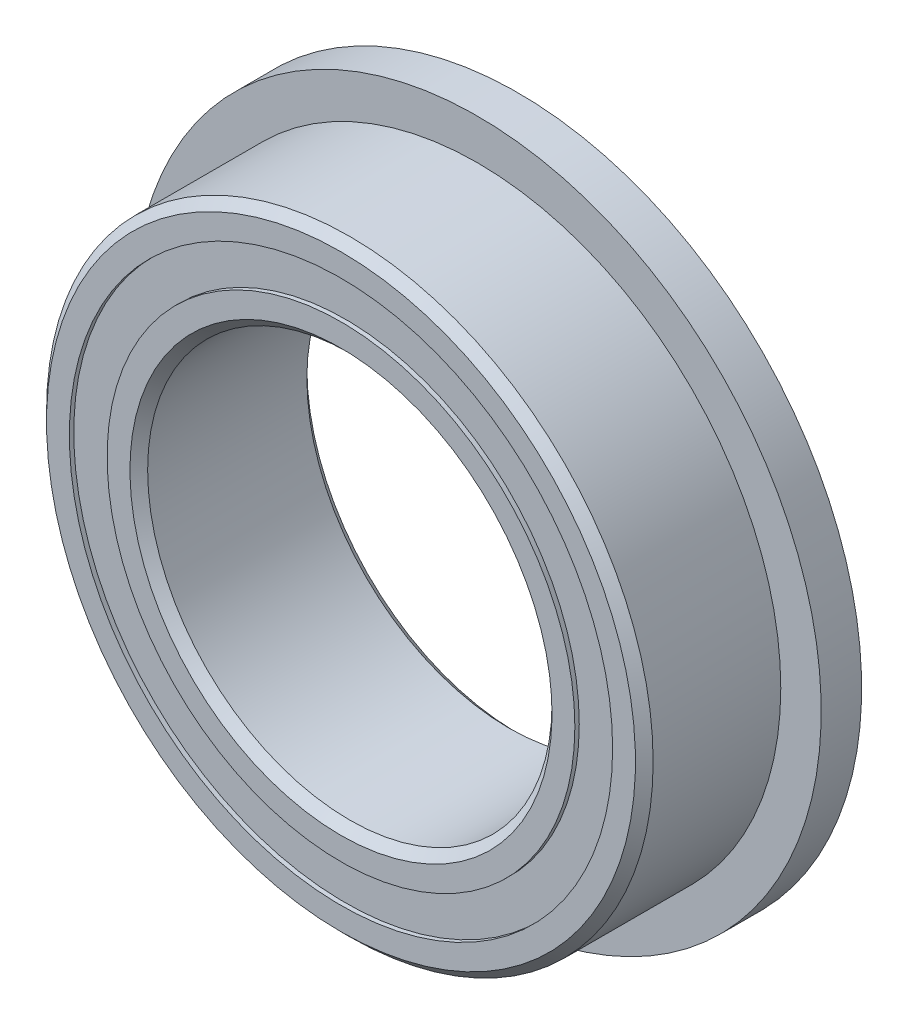
ISO-10303-21;
HEADER;
FILE_DESCRIPTION(('STEP AP214'),'2;1');
FILE_NAME('part.step','',(''),(''),'','','');
FILE_SCHEMA(('AUTOMOTIVE_DESIGN { 1 0 10303 214 1 1 1 1 }'));
ENDSEC;
DATA;
#1=APPLICATION_CONTEXT('core data for automotive mechanical design processes');
#2=APPLICATION_PROTOCOL_DEFINITION('international standard','automotive_design',2000,#1);
#3=PRODUCT_CONTEXT('',#1,'mechanical');
#4=PRODUCT('Part','Part','',(#3));
#5=PRODUCT_RELATED_PRODUCT_CATEGORY('part','',(#4));
#6=PRODUCT_DEFINITION_FORMATION('','',#4);
#7=PRODUCT_DEFINITION_CONTEXT('part definition',#1,'design');
#8=PRODUCT_DEFINITION('design','',#6,#7);
#9=PRODUCT_DEFINITION_SHAPE('','',#8);
#10=(LENGTH_UNIT() NAMED_UNIT(*) SI_UNIT(.MILLI.,.METRE.));
#11=(NAMED_UNIT(*) PLANE_ANGLE_UNIT() SI_UNIT($,.RADIAN.));
#12=(NAMED_UNIT(*) SI_UNIT($,.STERADIAN.) SOLID_ANGLE_UNIT());
#13=UNCERTAINTY_MEASURE_WITH_UNIT(LENGTH_MEASURE(1.E-05),#10,'distance_accuracy_value','');
#14=(GEOMETRIC_REPRESENTATION_CONTEXT(3) GLOBAL_UNCERTAINTY_ASSIGNED_CONTEXT((#13)) GLOBAL_UNIT_ASSIGNED_CONTEXT((#10,
#11,#12)) REPRESENTATION_CONTEXT('',''));
#15=CARTESIAN_POINT('',(0.,0.,0.));
#16=DIRECTION('',(0.,0.,1.));
#17=DIRECTION('',(1.,0.,0.));
#18=AXIS2_PLACEMENT_3D('',#15,#16,#17);
#19=CARTESIAN_POINT('',(4.33012701892218,-2.50000000000002,0.));
#20=DIRECTION('',(0.866025403784436,-0.500000000000004,0.));
#21=DIRECTION('',(0.,0.,-1.));
#22=AXIS2_PLACEMENT_3D('',#19,#20,#21);
#23=SPHERICAL_SURFACE('',#22,0.862864380232568);
#24=CARTESIAN_POINT('',(3.58286454562007,-2.06856780988373,0.));
#25=VERTEX_POINT('',#24);
#26=VERTEX_LOOP('',#25);
#27=FACE_BOUND('',#26,.T.);
#28=CARTESIAN_POINT('',(5.0773894922243,-2.93143219011631,0.));
#29=VERTEX_POINT('',#28);
#30=VERTEX_LOOP('',#29);
#31=FACE_BOUND('',#30,.T.);
#32=ADVANCED_FACE('P0_F15',(#27,#31),#23,.T.);
#33=CLOSED_SHELL('',(#32));
#34=MANIFOLD_SOLID_BREP('P0_B1',#33);
#35=CARTESIAN_POINT('',(2.49999999999997,-4.33012701892221,0.));
#36=DIRECTION('',(0.499999999999995,-0.866025403784441,0.));
#37=DIRECTION('',(0.,0.,-1.));
#38=AXIS2_PLACEMENT_3D('',#35,#36,#37);
#39=SPHERICAL_SURFACE('',#38,0.862864380232568);
#40=CARTESIAN_POINT('',(2.93143219011625,-5.07738949222433,0.));
#41=VERTEX_POINT('',#40);
#42=VERTEX_LOOP('',#41);
#43=FACE_BOUND('',#42,.T.);
#44=CARTESIAN_POINT('',(2.0685678098837,-3.58286454562009,0.));
#45=VERTEX_POINT('',#44);
#46=VERTEX_LOOP('',#45);
#47=FACE_BOUND('',#46,.T.);
#48=ADVANCED_FACE('P1_F15',(#43,#47),#39,.T.);
#49=CLOSED_SHELL('',(#48));
#50=MANIFOLD_SOLID_BREP('P1_B1',#49);
#51=CARTESIAN_POINT('',(0.,5.,0.));
#52=DIRECTION('',(0.,1.,0.));
#53=DIRECTION('',(0.,0.,-1.));
#54=AXIS2_PLACEMENT_3D('',#51,#52,#53);
#55=SPHERICAL_SURFACE('',#54,0.862864380232568);
#56=CARTESIAN_POINT('',(0.,5.86286438023257,0.));
#57=VERTEX_POINT('',#56);
#58=VERTEX_LOOP('',#57);
#59=FACE_BOUND('',#58,.T.);
#60=CARTESIAN_POINT('',(0.,4.13713561976743,0.));
#61=VERTEX_POINT('',#60);
#62=VERTEX_LOOP('',#61);
#63=FACE_BOUND('',#62,.T.);
#64=ADVANCED_FACE('P2_F15',(#59,#63),#55,.T.);
#65=CLOSED_SHELL('',(#64));
#66=MANIFOLD_SOLID_BREP('P2_B1',#65);
#67=CARTESIAN_POINT('',(-4.33012701892216,2.50000000000005,0.));
#68=DIRECTION('',(-0.866025403784433,0.50000000000001,0.));
#69=DIRECTION('',(0.,0.,-1.));
#70=AXIS2_PLACEMENT_3D('',#67,#68,#69);
#71=SPHERICAL_SURFACE('',#70,0.862864380232568);
#72=CARTESIAN_POINT('',(-5.07738949222428,2.93143219011634,0.));
#73=VERTEX_POINT('',#72);
#74=VERTEX_LOOP('',#73);
#75=FACE_BOUND('',#74,.T.);
#76=CARTESIAN_POINT('',(-3.58286454562005,2.06856780988376,0.));
#77=VERTEX_POINT('',#76);
#78=VERTEX_LOOP('',#77);
#79=FACE_BOUND('',#78,.T.);
#80=ADVANCED_FACE('P3_F15',(#75,#79),#71,.T.);
#81=CLOSED_SHELL('',(#80));
#82=MANIFOLD_SOLID_BREP('P3_B1',#81);
#83=CARTESIAN_POINT('',(4.3301270189222,2.49999999999999,0.));
#84=DIRECTION('',(0.86602540378444,0.499999999999998,0.));
#85=DIRECTION('',(0.,0.,-1.));
#86=AXIS2_PLACEMENT_3D('',#83,#84,#85);
#87=SPHERICAL_SURFACE('',#86,0.862864380232568);
#88=CARTESIAN_POINT('',(5.07738949222432,2.93143219011627,0.));
#89=VERTEX_POINT('',#88);
#90=VERTEX_LOOP('',#89);
#91=FACE_BOUND('',#90,.T.);
#92=CARTESIAN_POINT('',(3.58286454562008,2.06856780988371,0.));
#93=VERTEX_POINT('',#92);
#94=VERTEX_LOOP('',#93);
#95=FACE_BOUND('',#94,.T.);
#96=ADVANCED_FACE('P4_F15',(#91,#95),#87,.T.);
#97=CLOSED_SHELL('',(#96));
#98=MANIFOLD_SOLID_BREP('P4_B1',#97);
#99=CARTESIAN_POINT('',(-2.49999999999994,4.33012701892223,0.));
#100=DIRECTION('',(-0.499999999999989,0.866025403784445,0.));
#101=DIRECTION('',(0.,0.,-1.));
#102=AXIS2_PLACEMENT_3D('',#99,#100,#101);
#103=SPHERICAL_SURFACE('',#102,0.862864380232568);
#104=CARTESIAN_POINT('',(-2.93143219011622,5.07738949222435,0.));
#105=VERTEX_POINT('',#104);
#106=VERTEX_LOOP('',#105);
#107=FACE_BOUND('',#106,.T.);
#108=CARTESIAN_POINT('',(-2.06856780988367,3.5828645456201,0.));
#109=VERTEX_POINT('',#108);
#110=VERTEX_LOOP('',#109);
#111=FACE_BOUND('',#110,.T.);
#112=ADVANCED_FACE('P5_F15',(#107,#111),#103,.T.);
#113=CLOSED_SHELL('',(#112));
#114=MANIFOLD_SOLID_BREP('P5_B1',#113);
#115=CARTESIAN_POINT('',(0.,5.37362637362637,0.862864380232567));
#116=DIRECTION('',(0.,0.,1.));
#117=DIRECTION('',(1.,0.,0.));
#118=AXIS2_PLACEMENT_3D('',#115,#116,#117);
#119=PLANE('',#118);
#120=CARTESIAN_POINT('',(0.,0.,0.862864380232567));
#121=DIRECTION('',(0.,0.,1.));
#122=DIRECTION('',(1.,0.,0.));
#123=AXIS2_PLACEMENT_3D('',#120,#121,#122);
#124=CIRCLE('',#123,4.62637362637362);
#125=CARTESIAN_POINT('',(4.62637362637362,0.,0.862864380232567));
#126=VERTEX_POINT('',#125);
#127=EDGE_CURVE('P6_E17',#126,#126,#124,.T.);
#128=ORIENTED_EDGE('',*,*,#127,.T.);
#129=EDGE_LOOP('',(#128));
#130=FACE_BOUND('',#129,.T.);
#131=CARTESIAN_POINT('',(0.,0.,0.862864380232567));
#132=DIRECTION('',(0.,0.,1.));
#133=DIRECTION('',(1.,0.,0.));
#134=AXIS2_PLACEMENT_3D('',#131,#132,#133);
#135=CIRCLE('',#134,5.37362637362637);
#136=CARTESIAN_POINT('',(5.37362637362637,0.,0.862864380232567));
#137=VERTEX_POINT('',#136);
#138=EDGE_CURVE('P6_E26',#137,#137,#135,.T.);
#139=ORIENTED_EDGE('',*,*,#138,.F.);
#140=EDGE_LOOP('',(#139));
#141=FACE_BOUND('',#140,.T.);
#142=ADVANCED_FACE('P6_F14',(#130,#141),#119,.F.);
#143=CARTESIAN_POINT('',(0.,0.,1.75));
#144=DIRECTION('',(0.,0.,1.));
#145=DIRECTION('',(1.,0.,0.));
#146=AXIS2_PLACEMENT_3D('',#143,#144,#145);
#147=CYLINDRICAL_SURFACE('',#146,4.62637362637362);
#148=ORIENTED_EDGE('',*,*,#127,.F.);
#149=EDGE_LOOP('',(#148));
#150=FACE_BOUND('',#149,.T.);
#151=CARTESIAN_POINT('',(0.,0.,1.6625));
#152=DIRECTION('',(0.,0.,1.));
#153=DIRECTION('',(1.,0.,0.));
#154=AXIS2_PLACEMENT_3D('',#151,#152,#153);
#155=CIRCLE('',#154,4.62637362637362);
#156=CARTESIAN_POINT('',(4.62637362637362,0.,1.6625));
#157=VERTEX_POINT('',#156);
#158=EDGE_CURVE('P6_E21',#157,#157,#155,.T.);
#159=ORIENTED_EDGE('',*,*,#158,.T.);
#160=EDGE_LOOP('',(#159));
#161=FACE_BOUND('',#160,.T.);
#162=ADVANCED_FACE('P6_F36',(#150,#161),#147,.F.);
#163=CARTESIAN_POINT('',(0.,0.,1.75));
#164=DIRECTION('',(0.,0.,1.));
#165=DIRECTION('',(1.,0.,0.));
#166=AXIS2_PLACEMENT_3D('',#163,#164,#165);
#167=CYLINDRICAL_SURFACE('',#166,5.37362637362637);
#168=CARTESIAN_POINT('',(0.,0.,1.6625));
#169=DIRECTION('',(0.,0.,1.));
#170=DIRECTION('',(1.,0.,0.));
#171=AXIS2_PLACEMENT_3D('',#168,#169,#170);
#172=CIRCLE('',#171,5.37362637362637);
#173=CARTESIAN_POINT('',(5.37362637362637,0.,1.6625));
#174=VERTEX_POINT('',#173);
#175=EDGE_CURVE('P6_E10',#174,#174,#172,.F.);
#176=ORIENTED_EDGE('',*,*,#175,.T.);
#177=EDGE_LOOP('',(#176));
#178=FACE_BOUND('',#177,.T.);
#179=ORIENTED_EDGE('',*,*,#138,.T.);
#180=EDGE_LOOP('',(#179));
#181=FACE_BOUND('',#180,.T.);
#182=ADVANCED_FACE('P6_F39',(#178,#181),#167,.T.);
#183=CARTESIAN_POINT('',(0.,5.37362637362637,1.6625));
#184=DIRECTION('',(0.,0.,-1.));
#185=DIRECTION('',(-1.,0.,0.));
#186=AXIS2_PLACEMENT_3D('',#183,#184,#185);
#187=PLANE('',#186);
#188=ORIENTED_EDGE('',*,*,#175,.F.);
#189=EDGE_LOOP('',(#188));
#190=FACE_BOUND('',#189,.T.);
#191=ORIENTED_EDGE('',*,*,#158,.F.);
#192=EDGE_LOOP('',(#191));
#193=FACE_BOUND('',#192,.T.);
#194=ADVANCED_FACE('P6_F42',(#190,#193),#187,.F.);
#195=CLOSED_SHELL('',(#142,#162,#182,#194));
#196=MANIFOLD_SOLID_BREP('P6_B1',#195);
#197=CARTESIAN_POINT('',(-5.,0.,0.));
#198=DIRECTION('',(-1.,0.,0.));
#199=DIRECTION('',(0.,0.,-1.));
#200=AXIS2_PLACEMENT_3D('',#197,#198,#199);
#201=SPHERICAL_SURFACE('',#200,0.862864380232568);
#202=CARTESIAN_POINT('',(-4.13713561976743,0.,0.));
#203=VERTEX_POINT('',#202);
#204=VERTEX_LOOP('',#203);
#205=FACE_BOUND('',#204,.T.);
#206=CARTESIAN_POINT('',(-5.86286438023257,0.,0.));
#207=VERTEX_POINT('',#206);
#208=VERTEX_LOOP('',#207);
#209=FACE_BOUND('',#208,.T.);
#210=ADVANCED_FACE('P7_F15',(#205,#209),#201,.T.);
#211=CLOSED_SHELL('',(#210));
#212=MANIFOLD_SOLID_BREP('P7_B1',#211);
#213=CARTESIAN_POINT('',(0.,5.825,1.75));
#214=DIRECTION('',(0.,0.,-1.));
#215=DIRECTION('',(-1.,0.,0.));
#216=AXIS2_PLACEMENT_3D('',#213,#214,#215);
#217=PLANE('',#216);
#218=CARTESIAN_POINT('',(0.,0.,1.74999999995862));
#219=DIRECTION('',(0.,0.,-1.));
#220=DIRECTION('',(0.,1.,0.));
#221=AXIS2_PLACEMENT_3D('',#218,#219,#220);
#222=CIRCLE('',#221,5.82500000001573);
#223=CARTESIAN_POINT('',(0.,5.82500000001573,1.74999999995862));
#224=VERTEX_POINT('',#223);
#225=EDGE_CURVE('P8_E17',#224,#224,#222,.T.);
#226=ORIENTED_EDGE('',*,*,#225,.F.);
#227=EDGE_LOOP('',(#226));
#228=FACE_BOUND('',#227,.T.);
#229=CARTESIAN_POINT('',(0.,0.,1.75));
#230=DIRECTION('',(0.,0.,1.));
#231=DIRECTION('',(1.,0.,0.));
#232=AXIS2_PLACEMENT_3D('',#229,#230,#231);
#233=CIRCLE('',#232,5.37362637362637);
#234=CARTESIAN_POINT('',(5.37362637362637,0.,1.75));
#235=VERTEX_POINT('',#234);
#236=EDGE_CURVE('P8_E38',#235,#235,#233,.F.);
#237=ORIENTED_EDGE('',*,*,#236,.T.);
#238=EDGE_LOOP('',(#237));
#239=FACE_BOUND('',#238,.T.);
#240=ADVANCED_FACE('P8_F14',(#228,#239),#217,.F.);
#241=CARTESIAN_POINT('',(0.,0.,1.57500000000255));
#242=DIRECTION('',(0.,0.,-1.));
#243=DIRECTION('',(0.,1.,0.));
#244=AXIS2_PLACEMENT_3D('',#241,#242,#243);
#245=CONICAL_SURFACE('',#244,6.00000000002865,0.785398163559858);
#246=ORIENTED_EDGE('',*,*,#225,.T.);
#247=EDGE_LOOP('',(#246));
#248=FACE_BOUND('',#247,.T.);
#249=CARTESIAN_POINT('',(0.,0.,1.575));
#250=DIRECTION('',(0.,0.,1.));
#251=DIRECTION('',(1.,0.,0.));
#252=AXIS2_PLACEMENT_3D('',#249,#250,#251);
#253=CIRCLE('',#252,6.);
#254=CARTESIAN_POINT('',(6.,0.,1.575));
#255=VERTEX_POINT('',#254);
#256=EDGE_CURVE('P8_E29',#255,#255,#253,.F.);
#257=ORIENTED_EDGE('',*,*,#256,.F.);
#258=EDGE_LOOP('',(#257));
#259=FACE_BOUND('',#258,.T.);
#260=ADVANCED_FACE('P8_F46',(#248,#259),#245,.T.);
#261=CARTESIAN_POINT('',(0.,0.,1.75));
#262=DIRECTION('',(0.,0.,1.));
#263=DIRECTION('',(1.,0.,0.));
#264=AXIS2_PLACEMENT_3D('',#261,#262,#263);
#265=CYLINDRICAL_SURFACE('',#264,5.37362637362637);
#266=CARTESIAN_POINT('',(0.,0.,0.777777777777777));
#267=DIRECTION('',(0.,0.,1.));
#268=DIRECTION('',(1.,0.,0.));
#269=AXIS2_PLACEMENT_3D('',#266,#267,#268);
#270=CIRCLE('',#269,5.37362637362637);
#271=CARTESIAN_POINT('',(5.37362637362637,0.,0.777777777777777));
#272=VERTEX_POINT('',#271);
#273=EDGE_CURVE('P8_E37',#272,#272,#270,.F.);
#274=ORIENTED_EDGE('',*,*,#273,.T.);
#275=EDGE_LOOP('',(#274));
#276=FACE_BOUND('',#275,.T.);
#277=ORIENTED_EDGE('',*,*,#236,.F.);
#278=EDGE_LOOP('',(#277));
#279=FACE_BOUND('',#278,.T.);
#280=ADVANCED_FACE('P8_F54',(#276,#279),#265,.F.);
#281=CARTESIAN_POINT('',(0.,0.,1.75));
#282=DIRECTION('',(0.,0.,1.));
#283=DIRECTION('',(1.,0.,0.));
#284=AXIS2_PLACEMENT_3D('',#281,#282,#283);
#285=CYLINDRICAL_SURFACE('',#284,6.);
#286=CARTESIAN_POINT('',(0.,0.,-0.95));
#287=DIRECTION('',(0.,0.,1.));
#288=DIRECTION('',(1.,0.,0.));
#289=AXIS2_PLACEMENT_3D('',#286,#287,#288);
#290=CIRCLE('',#289,6.);
#291=CARTESIAN_POINT('',(6.,0.,-0.95));
#292=VERTEX_POINT('',#291);
#293=EDGE_CURVE('P8_E35',#292,#292,#290,.F.);
#294=ORIENTED_EDGE('',*,*,#293,.F.);
#295=EDGE_LOOP('',(#294));
#296=FACE_BOUND('',#295,.T.);
#297=ORIENTED_EDGE('',*,*,#256,.T.);
#298=EDGE_LOOP('',(#297));
#299=FACE_BOUND('',#298,.T.);
#300=ADVANCED_FACE('P8_F78',(#296,#299),#285,.T.);
#301=CARTESIAN_POINT('',(0.,0.,0.));
#302=DIRECTION('',(0.,0.,1.));
#303=DIRECTION('',(1.,0.,0.));
#304=AXIS2_PLACEMENT_3D('',#301,#302,#303);
#305=TOROIDAL_SURFACE('',#304,5.,0.862864380232568);
#306=CARTESIAN_POINT('',(0.,0.,-0.777777777777778));
#307=DIRECTION('',(0.,0.,1.));
#308=DIRECTION('',(1.,0.,0.));
#309=AXIS2_PLACEMENT_3D('',#306,#307,#308);
#310=CIRCLE('',#309,5.37362637362637);
#311=CARTESIAN_POINT('',(5.37362637362637,0.,-0.777777777777778));
#312=VERTEX_POINT('',#311);
#313=EDGE_CURVE('P8_E34',#312,#312,#310,.F.);
#314=ORIENTED_EDGE('',*,*,#313,.T.);
#315=EDGE_LOOP('',(#314));
#316=FACE_BOUND('',#315,.T.);
#317=ORIENTED_EDGE('',*,*,#273,.F.);
#318=EDGE_LOOP('',(#317));
#319=FACE_BOUND('',#318,.T.);
#320=ADVANCED_FACE('P8_F73',(#316,#319),#305,.F.);
#321=CARTESIAN_POINT('',(0.,5.37362637362637,-0.95));
#322=DIRECTION('',(0.,0.,1.));
#323=DIRECTION('',(1.,0.,0.));
#324=AXIS2_PLACEMENT_3D('',#321,#322,#323);
#325=PLANE('',#324);
#326=ORIENTED_EDGE('',*,*,#293,.T.);
#327=EDGE_LOOP('',(#326));
#328=FACE_BOUND('',#327,.T.);
#329=CARTESIAN_POINT('',(0.,0.,-0.95));
#330=DIRECTION('',(0.,0.,-1.));
#331=DIRECTION('',(-1.,0.,0.));
#332=AXIS2_PLACEMENT_3D('',#329,#330,#331);
#333=CIRCLE('',#332,6.8);
#334=CARTESIAN_POINT('',(-6.8,0.,-0.95));
#335=VERTEX_POINT('',#334);
#336=EDGE_CURVE('P8_E26',#335,#335,#333,.T.);
#337=ORIENTED_EDGE('',*,*,#336,.F.);
#338=EDGE_LOOP('',(#337));
#339=FACE_BOUND('',#338,.T.);
#340=ADVANCED_FACE('P8_F69',(#328,#339),#325,.T.);
#341=CARTESIAN_POINT('',(0.,0.,1.75));
#342=DIRECTION('',(0.,0.,1.));
#343=DIRECTION('',(1.,0.,0.));
#344=AXIS2_PLACEMENT_3D('',#341,#342,#343);
#345=CYLINDRICAL_SURFACE('',#344,5.37362637362637);
#346=CARTESIAN_POINT('',(0.,0.,-1.75));
#347=DIRECTION('',(0.,0.,1.));
#348=DIRECTION('',(1.,0.,0.));
#349=AXIS2_PLACEMENT_3D('',#346,#347,#348);
#350=CIRCLE('',#349,5.37362637362637);
#351=CARTESIAN_POINT('',(5.37362637362637,0.,-1.75));
#352=VERTEX_POINT('',#351);
#353=EDGE_CURVE('P8_E21',#352,#352,#350,.F.);
#354=ORIENTED_EDGE('',*,*,#353,.T.);
#355=EDGE_LOOP('',(#354));
#356=FACE_BOUND('',#355,.T.);
#357=ORIENTED_EDGE('',*,*,#313,.F.);
#358=EDGE_LOOP('',(#357));
#359=FACE_BOUND('',#358,.T.);
#360=ADVANCED_FACE('P8_F63',(#356,#359),#345,.F.);
#361=CARTESIAN_POINT('',(0.,0.,-1.75));
#362=DIRECTION('',(0.,0.,-1.));
#363=DIRECTION('',(-1.,0.,0.));
#364=AXIS2_PLACEMENT_3D('',#361,#362,#363);
#365=CYLINDRICAL_SURFACE('',#364,6.8);
#366=CARTESIAN_POINT('',(0.,0.,-1.75));
#367=DIRECTION('',(0.,0.,-1.));
#368=DIRECTION('',(-1.,0.,0.));
#369=AXIS2_PLACEMENT_3D('',#366,#367,#368);
#370=CIRCLE('',#369,6.8);
#371=CARTESIAN_POINT('',(-6.8,0.,-1.75));
#372=VERTEX_POINT('',#371);
#373=EDGE_CURVE('P8_E10',#372,#372,#370,.F.);
#374=ORIENTED_EDGE('',*,*,#373,.T.);
#375=EDGE_LOOP('',(#374));
#376=FACE_BOUND('',#375,.T.);
#377=ORIENTED_EDGE('',*,*,#336,.T.);
#378=EDGE_LOOP('',(#377));
#379=FACE_BOUND('',#378,.T.);
#380=ADVANCED_FACE('P8_F57',(#376,#379),#365,.T.);
#381=CARTESIAN_POINT('',(0.,5.825,-1.75));
#382=DIRECTION('',(0.,0.,1.));
#383=DIRECTION('',(1.,0.,0.));
#384=AXIS2_PLACEMENT_3D('',#381,#382,#383);
#385=PLANE('',#384);
#386=ORIENTED_EDGE('',*,*,#373,.F.);
#387=EDGE_LOOP('',(#386));
#388=FACE_BOUND('',#387,.T.);
#389=ORIENTED_EDGE('',*,*,#353,.F.);
#390=EDGE_LOOP('',(#389));
#391=FACE_BOUND('',#390,.T.);
#392=ADVANCED_FACE('P8_F55',(#388,#391),#385,.F.);
#393=CLOSED_SHELL('',(#240,#260,#280,#300,#320,#340,#360,#380,#392));
#394=MANIFOLD_SOLID_BREP('P8_B1',#393);
#395=CARTESIAN_POINT('',(0.,0.,0.));
#396=DIRECTION('',(0.,0.,1.));
#397=DIRECTION('',(1.,0.,0.));
#398=AXIS2_PLACEMENT_3D('',#395,#396,#397);
#399=TOROIDAL_SURFACE('',#398,4.99999999999999,0.862864380232566);
#400=CARTESIAN_POINT('',(0.,0.,0.777777777777778));
#401=DIRECTION('',(0.,0.,1.));
#402=DIRECTION('',(1.,0.,0.));
#403=AXIS2_PLACEMENT_3D('',#400,#401,#402);
#404=CIRCLE('',#403,4.62637362637362);
#405=CARTESIAN_POINT('',(4.62637362637362,0.,0.777777777777778));
#406=VERTEX_POINT('',#405);
#407=EDGE_CURVE('P9_E32',#406,#406,#404,.T.);
#408=ORIENTED_EDGE('',*,*,#407,.F.);
#409=EDGE_LOOP('',(#408));
#410=FACE_BOUND('',#409,.T.);
#411=CARTESIAN_POINT('',(0.,0.,-0.777777777777779));
#412=DIRECTION('',(0.,0.,1.));
#413=DIRECTION('',(1.,0.,0.));
#414=AXIS2_PLACEMENT_3D('',#411,#412,#413);
#415=CIRCLE('',#414,4.62637362637362);
#416=CARTESIAN_POINT('',(4.62637362637362,0.,-0.777777777777779));
#417=VERTEX_POINT('',#416);
#418=EDGE_CURVE('P9_E30',#417,#417,#415,.F.);
#419=ORIENTED_EDGE('',*,*,#418,.F.);
#420=EDGE_LOOP('',(#419));
#421=FACE_BOUND('',#420,.T.);
#422=ADVANCED_FACE('P9_F14',(#410,#421),#399,.F.);
#423=CARTESIAN_POINT('',(0.,0.,1.75));
#424=DIRECTION('',(0.,0.,1.));
#425=DIRECTION('',(1.,0.,0.));
#426=AXIS2_PLACEMENT_3D('',#423,#424,#425);
#427=CYLINDRICAL_SURFACE('',#426,4.62637362637362);
#428=CARTESIAN_POINT('',(0.,0.,1.75));
#429=DIRECTION('',(0.,0.,1.));
#430=DIRECTION('',(1.,0.,0.));
#431=AXIS2_PLACEMENT_3D('',#428,#429,#430);
#432=CIRCLE('',#431,4.62637362637362);
#433=CARTESIAN_POINT('',(4.62637362637362,0.,1.75));
#434=VERTEX_POINT('',#433);
#435=EDGE_CURVE('P9_E18',#434,#434,#432,.F.);
#436=ORIENTED_EDGE('',*,*,#435,.T.);
#437=EDGE_LOOP('',(#436));
#438=FACE_BOUND('',#437,.T.);
#439=ORIENTED_EDGE('',*,*,#407,.T.);
#440=EDGE_LOOP('',(#439));
#441=FACE_BOUND('',#440,.T.);
#442=ADVANCED_FACE('P9_F48',(#438,#441),#427,.T.);
#443=CARTESIAN_POINT('',(0.,0.,1.75));
#444=DIRECTION('',(0.,0.,1.));
#445=DIRECTION('',(1.,0.,0.));
#446=AXIS2_PLACEMENT_3D('',#443,#444,#445);
#447=CYLINDRICAL_SURFACE('',#446,4.62637362637362);
#448=ORIENTED_EDGE('',*,*,#418,.T.);
#449=EDGE_LOOP('',(#448));
#450=FACE_BOUND('',#449,.T.);
#451=CARTESIAN_POINT('',(0.,0.,-1.75));
#452=DIRECTION('',(0.,0.,1.));
#453=DIRECTION('',(1.,0.,0.));
#454=AXIS2_PLACEMENT_3D('',#451,#452,#453);
#455=CIRCLE('',#454,4.62637362637362);
#456=CARTESIAN_POINT('',(4.62637362637362,0.,-1.75));
#457=VERTEX_POINT('',#456);
#458=EDGE_CURVE('P9_E41',#457,#457,#455,.T.);
#459=ORIENTED_EDGE('',*,*,#458,.T.);
#460=EDGE_LOOP('',(#459));
#461=FACE_BOUND('',#460,.T.);
#462=ADVANCED_FACE('P9_F55',(#450,#461),#447,.T.);
#463=CARTESIAN_POINT('',(0.,4.62637362637362,1.75));
#464=DIRECTION('',(0.,0.,-1.));
#465=DIRECTION('',(-1.,0.,0.));
#466=AXIS2_PLACEMENT_3D('',#463,#464,#465);
#467=PLANE('',#466);
#468=ORIENTED_EDGE('',*,*,#435,.F.);
#469=EDGE_LOOP('',(#468));
#470=FACE_BOUND('',#469,.T.);
#471=CARTESIAN_POINT('',(0.,0.,1.74999999995862));
#472=DIRECTION('',(0.,0.,1.));
#473=DIRECTION('',(0.,-1.,0.));
#474=AXIS2_PLACEMENT_3D('',#471,#472,#473);
#475=CIRCLE('',#474,4.17499999997517);
#476=CARTESIAN_POINT('',(0.,-4.17499999997517,1.74999999995862));
#477=VERTEX_POINT('',#476);
#478=EDGE_CURVE('P9_E39',#477,#477,#475,.F.);
#479=ORIENTED_EDGE('',*,*,#478,.T.);
#480=EDGE_LOOP('',(#479));
#481=FACE_BOUND('',#480,.T.);
#482=ADVANCED_FACE('P9_F51',(#470,#481),#467,.F.);
#483=CARTESIAN_POINT('',(0.,4.175,-1.75));
#484=DIRECTION('',(0.,0.,1.));
#485=DIRECTION('',(1.,0.,0.));
#486=AXIS2_PLACEMENT_3D('',#483,#484,#485);
#487=PLANE('',#486);
#488=CARTESIAN_POINT('',(0.,0.,-1.75000000001546));
#489=DIRECTION('',(0.,0.,-1.));
#490=DIRECTION('',(-1.,0.,0.));
#491=AXIS2_PLACEMENT_3D('',#488,#489,#490);
#492=CIRCLE('',#491,4.17499999997517);
#493=CARTESIAN_POINT('',(-4.17499999997517,0.,-1.75000000001546));
#494=VERTEX_POINT('',#493);
#495=EDGE_CURVE('P9_E27',#494,#494,#492,.F.);
#496=ORIENTED_EDGE('',*,*,#495,.T.);
#497=EDGE_LOOP('',(#496));
#498=FACE_BOUND('',#497,.T.);
#499=ORIENTED_EDGE('',*,*,#458,.F.);
#500=EDGE_LOOP('',(#499));
#501=FACE_BOUND('',#500,.T.);
#502=ADVANCED_FACE('P9_F54',(#498,#501),#487,.F.);
#503=CARTESIAN_POINT('',(0.,0.,1.74999999990177));
#504=DIRECTION('',(0.,0.,1.));
#505=DIRECTION('',(0.,-1.,0.));
#506=AXIS2_PLACEMENT_3D('',#503,#504,#505);
#507=CONICAL_SURFACE('',#506,4.17499999991833,0.785398163559858);
#508=ORIENTED_EDGE('',*,*,#478,.F.);
#509=EDGE_LOOP('',(#508));
#510=FACE_BOUND('',#509,.T.);
#511=CARTESIAN_POINT('',(0.,0.,1.575));
#512=DIRECTION('',(0.,0.,1.));
#513=DIRECTION('',(1.,0.,0.));
#514=AXIS2_PLACEMENT_3D('',#511,#512,#513);
#515=CIRCLE('',#514,4.);
#516=CARTESIAN_POINT('',(4.,0.,1.575));
#517=VERTEX_POINT('',#516);
#518=EDGE_CURVE('P9_E22',#517,#517,#515,.F.);
#519=ORIENTED_EDGE('',*,*,#518,.T.);
#520=EDGE_LOOP('',(#519));
#521=FACE_BOUND('',#520,.T.);
#522=ADVANCED_FACE('P9_F59',(#510,#521),#507,.F.);
#523=CARTESIAN_POINT('',(0.,0.,-1.75000000001546));
#524=DIRECTION('',(0.,0.,-1.));
#525=DIRECTION('',(-1.,0.,0.));
#526=AXIS2_PLACEMENT_3D('',#523,#524,#525);
#527=CONICAL_SURFACE('',#526,4.17499999997517,0.785398163235039);
#528=CARTESIAN_POINT('',(0.,0.,-1.575));
#529=DIRECTION('',(0.,0.,1.));
#530=DIRECTION('',(1.,0.,0.));
#531=AXIS2_PLACEMENT_3D('',#528,#529,#530);
#532=CIRCLE('',#531,4.);
#533=CARTESIAN_POINT('',(4.,0.,-1.575));
#534=VERTEX_POINT('',#533);
#535=EDGE_CURVE('P9_E10',#534,#534,#532,.T.);
#536=ORIENTED_EDGE('',*,*,#535,.T.);
#537=EDGE_LOOP('',(#536));
#538=FACE_BOUND('',#537,.T.);
#539=ORIENTED_EDGE('',*,*,#495,.F.);
#540=EDGE_LOOP('',(#539));
#541=FACE_BOUND('',#540,.T.);
#542=ADVANCED_FACE('P9_F62',(#538,#541),#527,.F.);
#543=CARTESIAN_POINT('',(0.,0.,1.75));
#544=DIRECTION('',(0.,0.,1.));
#545=DIRECTION('',(1.,0.,0.));
#546=AXIS2_PLACEMENT_3D('',#543,#544,#545);
#547=CYLINDRICAL_SURFACE('',#546,4.);
#548=ORIENTED_EDGE('',*,*,#518,.F.);
#549=EDGE_LOOP('',(#548));
#550=FACE_BOUND('',#549,.T.);
#551=ORIENTED_EDGE('',*,*,#535,.F.);
#552=EDGE_LOOP('',(#551));
#553=FACE_BOUND('',#552,.T.);
#554=ADVANCED_FACE('P9_F66',(#550,#553),#547,.F.);
#555=CLOSED_SHELL('',(#422,#442,#462,#482,#502,#522,#542,#554));
#556=MANIFOLD_SOLID_BREP('P9_B1',#555);
#557=CARTESIAN_POINT('',(0.,-5.,0.));
#558=DIRECTION('',(0.,-1.,0.));
#559=DIRECTION('',(0.,0.,-1.));
#560=AXIS2_PLACEMENT_3D('',#557,#558,#559);
#561=SPHERICAL_SURFACE('',#560,0.862864380232568);
#562=CARTESIAN_POINT('',(0.,-4.13713561976743,0.));
#563=VERTEX_POINT('',#562);
#564=VERTEX_LOOP('',#563);
#565=FACE_BOUND('',#564,.T.);
#566=CARTESIAN_POINT('',(0.,-5.86286438023257,0.));
#567=VERTEX_POINT('',#566);
#568=VERTEX_LOOP('',#567);
#569=FACE_BOUND('',#568,.T.);
#570=ADVANCED_FACE('P10_F15',(#565,#569),#561,.T.);
#571=CLOSED_SHELL('',(#570));
#572=MANIFOLD_SOLID_BREP('P10_B1',#571);
#573=CARTESIAN_POINT('',(5.,0.,0.));
#574=DIRECTION('',(1.,0.,0.));
#575=DIRECTION('',(0.,0.,-1.));
#576=AXIS2_PLACEMENT_3D('',#573,#574,#575);
#577=SPHERICAL_SURFACE('',#576,0.862864380232568);
#578=CARTESIAN_POINT('',(5.86286438023257,0.,0.));
#579=VERTEX_POINT('',#578);
#580=VERTEX_LOOP('',#579);
#581=FACE_BOUND('',#580,.T.);
#582=CARTESIAN_POINT('',(4.13713561976743,0.,0.));
#583=VERTEX_POINT('',#582);
#584=VERTEX_LOOP('',#583);
#585=FACE_BOUND('',#584,.T.);
#586=ADVANCED_FACE('P11_F15',(#581,#585),#577,.T.);
#587=CLOSED_SHELL('',(#586));
#588=MANIFOLD_SOLID_BREP('P11_B1',#587);
#589=CARTESIAN_POINT('',(-4.33012701892222,-2.49999999999996,0.));
#590=DIRECTION('',(-0.866025403784443,-0.499999999999992,0.));
#591=DIRECTION('',(0.,0.,-1.));
#592=AXIS2_PLACEMENT_3D('',#589,#590,#591);
#593=SPHERICAL_SURFACE('',#592,0.862864380232568);
#594=CARTESIAN_POINT('',(-5.07738949222434,-2.93143219011624,0.));
#595=VERTEX_POINT('',#594);
#596=VERTEX_LOOP('',#595);
#597=FACE_BOUND('',#596,.T.);
#598=CARTESIAN_POINT('',(-3.58286454562009,-2.06856780988368,0.));
#599=VERTEX_POINT('',#598);
#600=VERTEX_LOOP('',#599);
#601=FACE_BOUND('',#600,.T.);
#602=ADVANCED_FACE('P12_F15',(#597,#601),#593,.T.);
#603=CLOSED_SHELL('',(#602));
#604=MANIFOLD_SOLID_BREP('P12_B1',#603);
#605=CARTESIAN_POINT('',(-2.50000000000004,-4.33012701892217,0.));
#606=DIRECTION('',(-0.500000000000007,-0.866025403784435,0.));
#607=DIRECTION('',(0.,0.,-1.));
#608=AXIS2_PLACEMENT_3D('',#605,#606,#607);
#609=SPHERICAL_SURFACE('',#608,0.862864380232568);
#610=CARTESIAN_POINT('',(-2.06856780988375,-3.58286454562006,0.));
#611=VERTEX_POINT('',#610);
#612=VERTEX_LOOP('',#611);
#613=FACE_BOUND('',#612,.T.);
#614=CARTESIAN_POINT('',(-2.93143219011633,-5.07738949222429,0.));
#615=VERTEX_POINT('',#614);
#616=VERTEX_LOOP('',#615);
#617=FACE_BOUND('',#616,.T.);
#618=ADVANCED_FACE('P13_F15',(#613,#617),#609,.T.);
#619=CLOSED_SHELL('',(#618));
#620=MANIFOLD_SOLID_BREP('P13_B1',#619);
#621=CARTESIAN_POINT('',(0.,5.37362637362637,-0.862864380232568));
#622=DIRECTION('',(0.,0.,-1.));
#623=DIRECTION('',(-1.,0.,0.));
#624=AXIS2_PLACEMENT_3D('',#621,#622,#623);
#625=PLANE('',#624);
#626=CARTESIAN_POINT('',(0.,0.,-0.862864380232568));
#627=DIRECTION('',(0.,0.,1.));
#628=DIRECTION('',(1.,0.,0.));
#629=AXIS2_PLACEMENT_3D('',#626,#627,#628);
#630=CIRCLE('',#629,5.37362637362637);
#631=CARTESIAN_POINT('',(5.37362637362637,0.,-0.862864380232568));
#632=VERTEX_POINT('',#631);
#633=EDGE_CURVE('P14_E17',#632,#632,#630,.F.);
#634=ORIENTED_EDGE('',*,*,#633,.F.);
#635=EDGE_LOOP('',(#634));
#636=FACE_BOUND('',#635,.T.);
#637=CARTESIAN_POINT('',(0.,0.,-0.862864380232568));
#638=DIRECTION('',(0.,0.,1.));
#639=DIRECTION('',(1.,0.,0.));
#640=AXIS2_PLACEMENT_3D('',#637,#638,#639);
#641=CIRCLE('',#640,4.62637362637362);
#642=CARTESIAN_POINT('',(4.62637362637362,0.,-0.862864380232568));
#643=VERTEX_POINT('',#642);
#644=EDGE_CURVE('P14_E26',#643,#643,#641,.F.);
#645=ORIENTED_EDGE('',*,*,#644,.T.);
#646=EDGE_LOOP('',(#645));
#647=FACE_BOUND('',#646,.T.);
#648=ADVANCED_FACE('P14_F14',(#636,#647),#625,.F.);
#649=CARTESIAN_POINT('',(0.,0.,1.75));
#650=DIRECTION('',(0.,0.,1.));
#651=DIRECTION('',(1.,0.,0.));
#652=AXIS2_PLACEMENT_3D('',#649,#650,#651);
#653=CYLINDRICAL_SURFACE('',#652,5.37362637362637);
#654=ORIENTED_EDGE('',*,*,#633,.T.);
#655=EDGE_LOOP('',(#654));
#656=FACE_BOUND('',#655,.T.);
#657=CARTESIAN_POINT('',(0.,0.,-1.6625));
#658=DIRECTION('',(0.,0.,1.));
#659=DIRECTION('',(1.,0.,0.));
#660=AXIS2_PLACEMENT_3D('',#657,#658,#659);
#661=CIRCLE('',#660,5.37362637362637);
#662=CARTESIAN_POINT('',(5.37362637362637,0.,-1.6625));
#663=VERTEX_POINT('',#662);
#664=EDGE_CURVE('P14_E21',#663,#663,#661,.T.);
#665=ORIENTED_EDGE('',*,*,#664,.T.);
#666=EDGE_LOOP('',(#665));
#667=FACE_BOUND('',#666,.T.);
#668=ADVANCED_FACE('P14_F34',(#656,#667),#653,.T.);
#669=CARTESIAN_POINT('',(0.,0.,1.75));
#670=DIRECTION('',(0.,0.,1.));
#671=DIRECTION('',(1.,0.,0.));
#672=AXIS2_PLACEMENT_3D('',#669,#670,#671);
#673=CYLINDRICAL_SURFACE('',#672,4.62637362637362);
#674=CARTESIAN_POINT('',(0.,0.,-1.6625));
#675=DIRECTION('',(0.,0.,1.));
#676=DIRECTION('',(1.,0.,0.));
#677=AXIS2_PLACEMENT_3D('',#674,#675,#676);
#678=CIRCLE('',#677,4.62637362637362);
#679=CARTESIAN_POINT('',(4.62637362637362,0.,-1.6625));
#680=VERTEX_POINT('',#679);
#681=EDGE_CURVE('P14_E10',#680,#680,#678,.F.);
#682=ORIENTED_EDGE('',*,*,#681,.T.);
#683=EDGE_LOOP('',(#682));
#684=FACE_BOUND('',#683,.T.);
#685=ORIENTED_EDGE('',*,*,#644,.F.);
#686=EDGE_LOOP('',(#685));
#687=FACE_BOUND('',#686,.T.);
#688=ADVANCED_FACE('P14_F42',(#684,#687),#673,.F.);
#689=CARTESIAN_POINT('',(0.,5.37362637362637,-1.6625));
#690=DIRECTION('',(0.,0.,1.));
#691=DIRECTION('',(1.,0.,0.));
#692=AXIS2_PLACEMENT_3D('',#689,#690,#691);
#693=PLANE('',#692);
#694=ORIENTED_EDGE('',*,*,#681,.F.);
#695=EDGE_LOOP('',(#694));
#696=FACE_BOUND('',#695,.T.);
#697=ORIENTED_EDGE('',*,*,#664,.F.);
#698=EDGE_LOOP('',(#697));
#699=FACE_BOUND('',#698,.T.);
#700=ADVANCED_FACE('P14_F43',(#696,#699),#693,.F.);
#701=CLOSED_SHELL('',(#648,#668,#688,#700));
#702=MANIFOLD_SOLID_BREP('P14_B1',#701);
#703=CARTESIAN_POINT('',(2.50000000000001,4.33012701892219,0.));
#704=DIRECTION('',(0.500000000000001,0.866025403784438,0.));
#705=DIRECTION('',(0.,0.,-1.));
#706=AXIS2_PLACEMENT_3D('',#703,#704,#705);
#707=SPHERICAL_SURFACE('',#706,0.862864380232568);
#708=CARTESIAN_POINT('',(2.06856780988372,3.58286454562007,0.));
#709=VERTEX_POINT('',#708);
#710=VERTEX_LOOP('',#709);
#711=FACE_BOUND('',#710,.T.);
#712=CARTESIAN_POINT('',(2.93143219011629,5.07738949222431,0.));
#713=VERTEX_POINT('',#712);
#714=VERTEX_LOOP('',#713);
#715=FACE_BOUND('',#714,.T.);
#716=ADVANCED_FACE('P15_F15',(#711,#715),#707,.T.);
#717=CLOSED_SHELL('',(#716));
#718=MANIFOLD_SOLID_BREP('P15_B1',#717);
#719=ADVANCED_BREP_SHAPE_REPRESENTATION('',(#18,#34,#50,#66,#82,#98,#114,#196,#212,#394,#556,
#572,#588,#604,#620,#702,#718),#14);
#720=SHAPE_DEFINITION_REPRESENTATION(#9,#719);
ENDSEC;
END-ISO-10303-21;
